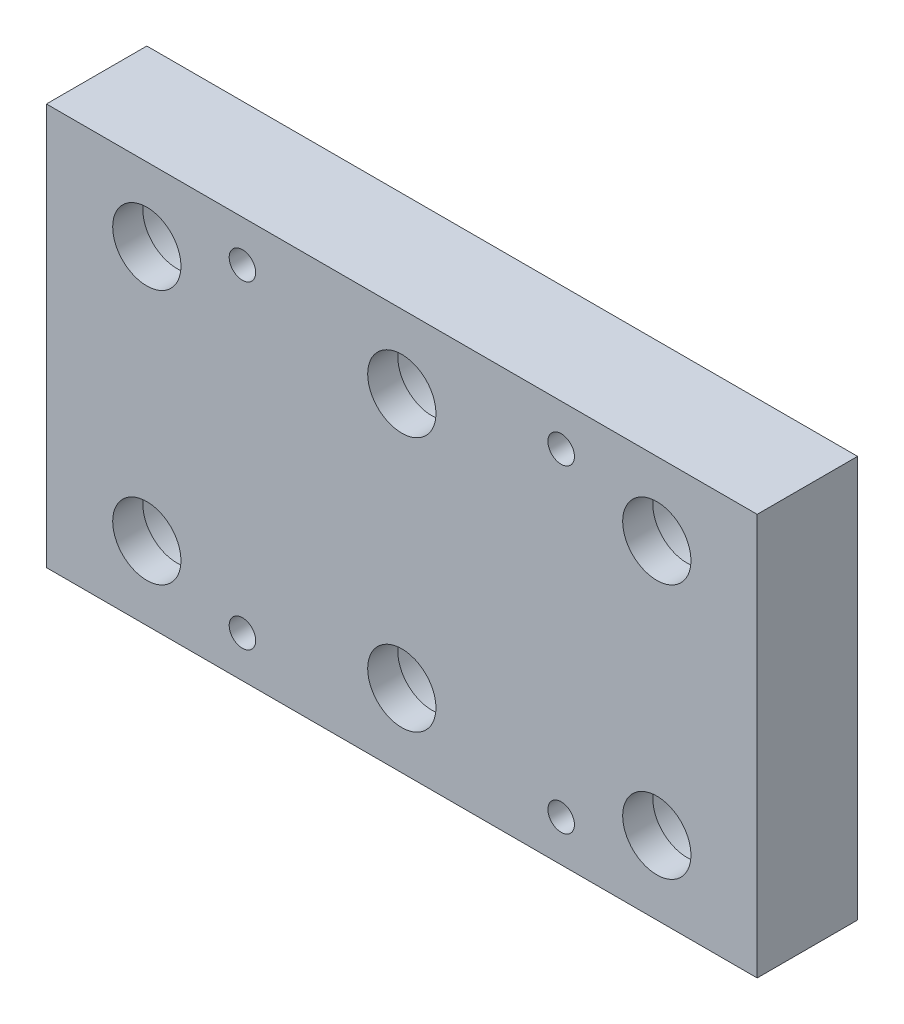
ISO-10303-21;
HEADER;
FILE_DESCRIPTION(('STEP AP214'),'2;1');
FILE_NAME('part.step','',(''),(''),'','','');
FILE_SCHEMA(('AUTOMOTIVE_DESIGN { 1 0 10303 214 1 1 1 1 }'));
ENDSEC;
DATA;
#1=APPLICATION_CONTEXT('core data for automotive mechanical design processes');
#2=APPLICATION_PROTOCOL_DEFINITION('international standard','automotive_design',2000,#1);
#3=PRODUCT_CONTEXT('',#1,'mechanical');
#4=PRODUCT('Part','Part','',(#3));
#5=PRODUCT_RELATED_PRODUCT_CATEGORY('part','',(#4));
#6=PRODUCT_DEFINITION_FORMATION('','',#4);
#7=PRODUCT_DEFINITION_CONTEXT('part definition',#1,'design');
#8=PRODUCT_DEFINITION('design','',#6,#7);
#9=PRODUCT_DEFINITION_SHAPE('','',#8);
#10=(LENGTH_UNIT() NAMED_UNIT(*) SI_UNIT(.MILLI.,.METRE.));
#11=(NAMED_UNIT(*) PLANE_ANGLE_UNIT() SI_UNIT($,.RADIAN.));
#12=(NAMED_UNIT(*) SI_UNIT($,.STERADIAN.) SOLID_ANGLE_UNIT());
#13=UNCERTAINTY_MEASURE_WITH_UNIT(LENGTH_MEASURE(1.E-05),#10,'distance_accuracy_value','');
#14=(GEOMETRIC_REPRESENTATION_CONTEXT(3) GLOBAL_UNCERTAINTY_ASSIGNED_CONTEXT((#13)) GLOBAL_UNIT_ASSIGNED_CONTEXT((#10,
#11,#12)) REPRESENTATION_CONTEXT('',''));
#15=CARTESIAN_POINT('',(0.,0.,0.));
#16=DIRECTION('',(0.,0.,1.));
#17=DIRECTION('',(1.,0.,0.));
#18=AXIS2_PLACEMENT_3D('',#15,#16,#17);
#19=CARTESIAN_POINT('',(-25.4,12.7,10.));
#20=DIRECTION('',(0.,0.,-1.));
#21=DIRECTION('',(-1.,0.,0.));
#22=AXIS2_PLACEMENT_3D('',#19,#20,#21);
#23=CYLINDRICAL_SURFACE('',#22,3.4);
#24=CARTESIAN_POINT('',(-25.4,12.7,10.));
#25=DIRECTION('',(0.,0.,-1.));
#26=DIRECTION('',(-1.,0.,0.));
#27=AXIS2_PLACEMENT_3D('',#24,#25,#26);
#28=CIRCLE('',#27,3.4);
#29=CARTESIAN_POINT('',(-28.8,12.7,10.));
#30=VERTEX_POINT('',#29);
#31=EDGE_CURVE('E165',#30,#30,#28,.T.);
#32=ORIENTED_EDGE('',*,*,#31,.F.);
#33=EDGE_LOOP('',(#32));
#34=FACE_BOUND('',#33,.T.);
#35=CARTESIAN_POINT('',(-25.4,12.7,7.));
#36=DIRECTION('',(0.,0.,-1.));
#37=DIRECTION('',(-1.,0.,0.));
#38=AXIS2_PLACEMENT_3D('',#35,#36,#37);
#39=CIRCLE('',#38,3.4);
#40=CARTESIAN_POINT('',(-28.8,12.7,7.));
#41=VERTEX_POINT('',#40);
#42=EDGE_CURVE('E39',#41,#41,#39,.F.);
#43=ORIENTED_EDGE('',*,*,#42,.F.);
#44=EDGE_LOOP('',(#43));
#45=FACE_BOUND('',#44,.T.);
#46=ADVANCED_FACE('F35',(#34,#45),#23,.F.);
#47=CARTESIAN_POINT('',(25.4,12.7,10.));
#48=DIRECTION('',(0.,0.,-1.));
#49=DIRECTION('',(-1.,0.,0.));
#50=AXIS2_PLACEMENT_3D('',#47,#48,#49);
#51=CYLINDRICAL_SURFACE('',#50,3.4);
#52=CARTESIAN_POINT('',(25.4,12.7,10.));
#53=DIRECTION('',(0.,0.,-1.));
#54=DIRECTION('',(-1.,0.,0.));
#55=AXIS2_PLACEMENT_3D('',#52,#53,#54);
#56=CIRCLE('',#55,3.4);
#57=CARTESIAN_POINT('',(22.,12.7,10.));
#58=VERTEX_POINT('',#57);
#59=EDGE_CURVE('E114',#58,#58,#56,.T.);
#60=ORIENTED_EDGE('',*,*,#59,.F.);
#61=EDGE_LOOP('',(#60));
#62=FACE_BOUND('',#61,.T.);
#63=CARTESIAN_POINT('',(25.4,12.7,7.));
#64=DIRECTION('',(0.,0.,-1.));
#65=DIRECTION('',(-1.,0.,0.));
#66=AXIS2_PLACEMENT_3D('',#63,#64,#65);
#67=CIRCLE('',#66,3.4);
#68=CARTESIAN_POINT('',(22.,12.7,7.));
#69=VERTEX_POINT('',#68);
#70=EDGE_CURVE('E130',#69,#69,#67,.F.);
#71=ORIENTED_EDGE('',*,*,#70,.F.);
#72=EDGE_LOOP('',(#71));
#73=FACE_BOUND('',#72,.T.);
#74=ADVANCED_FACE('F221',(#62,#73),#51,.F.);
#75=CARTESIAN_POINT('',(0.,12.7,10.));
#76=DIRECTION('',(0.,0.,-1.));
#77=DIRECTION('',(-1.,0.,0.));
#78=AXIS2_PLACEMENT_3D('',#75,#76,#77);
#79=CYLINDRICAL_SURFACE('',#78,3.4);
#80=CARTESIAN_POINT('',(0.,12.7,10.));
#81=DIRECTION('',(0.,0.,-1.));
#82=DIRECTION('',(-1.,0.,0.));
#83=AXIS2_PLACEMENT_3D('',#80,#81,#82);
#84=CIRCLE('',#83,3.4);
#85=CARTESIAN_POINT('',(-3.39999999999999,12.7,10.));
#86=VERTEX_POINT('',#85);
#87=EDGE_CURVE('E168',#86,#86,#84,.T.);
#88=ORIENTED_EDGE('',*,*,#87,.F.);
#89=EDGE_LOOP('',(#88));
#90=FACE_BOUND('',#89,.T.);
#91=CARTESIAN_POINT('',(0.,12.7,7.));
#92=DIRECTION('',(0.,0.,-1.));
#93=DIRECTION('',(-1.,0.,0.));
#94=AXIS2_PLACEMENT_3D('',#91,#92,#93);
#95=CIRCLE('',#94,3.4);
#96=CARTESIAN_POINT('',(-3.39999999999999,12.7,7.));
#97=VERTEX_POINT('',#96);
#98=EDGE_CURVE('E126',#97,#97,#95,.F.);
#99=ORIENTED_EDGE('',*,*,#98,.F.);
#100=EDGE_LOOP('',(#99));
#101=FACE_BOUND('',#100,.T.);
#102=ADVANCED_FACE('F227',(#90,#101),#79,.F.);
#103=CARTESIAN_POINT('',(25.4,-12.7,10.));
#104=DIRECTION('',(0.,0.,-1.));
#105=DIRECTION('',(-1.,0.,0.));
#106=AXIS2_PLACEMENT_3D('',#103,#104,#105);
#107=CYLINDRICAL_SURFACE('',#106,3.4);
#108=CARTESIAN_POINT('',(25.4,-12.7,10.));
#109=DIRECTION('',(0.,0.,-1.));
#110=DIRECTION('',(-1.,0.,0.));
#111=AXIS2_PLACEMENT_3D('',#108,#109,#110);
#112=CIRCLE('',#111,3.4);
#113=CARTESIAN_POINT('',(22.,-12.7,10.));
#114=VERTEX_POINT('',#113);
#115=EDGE_CURVE('E177',#114,#114,#112,.T.);
#116=ORIENTED_EDGE('',*,*,#115,.F.);
#117=EDGE_LOOP('',(#116));
#118=FACE_BOUND('',#117,.T.);
#119=CARTESIAN_POINT('',(25.4,-12.7,7.));
#120=DIRECTION('',(0.,0.,-1.));
#121=DIRECTION('',(-1.,0.,0.));
#122=AXIS2_PLACEMENT_3D('',#119,#120,#121);
#123=CIRCLE('',#122,3.4);
#124=CARTESIAN_POINT('',(22.,-12.7,7.));
#125=VERTEX_POINT('',#124);
#126=EDGE_CURVE('E121',#125,#125,#123,.F.);
#127=ORIENTED_EDGE('',*,*,#126,.F.);
#128=EDGE_LOOP('',(#127));
#129=FACE_BOUND('',#128,.T.);
#130=ADVANCED_FACE('F236',(#118,#129),#107,.F.);
#131=CARTESIAN_POINT('',(0.,-12.7,10.));
#132=DIRECTION('',(0.,0.,-1.));
#133=DIRECTION('',(-1.,0.,0.));
#134=AXIS2_PLACEMENT_3D('',#131,#132,#133);
#135=CYLINDRICAL_SURFACE('',#134,3.4);
#136=CARTESIAN_POINT('',(0.,-12.7,10.));
#137=DIRECTION('',(0.,0.,-1.));
#138=DIRECTION('',(-1.,0.,0.));
#139=AXIS2_PLACEMENT_3D('',#136,#137,#138);
#140=CIRCLE('',#139,3.4);
#141=CARTESIAN_POINT('',(-3.39999999999999,-12.7,10.));
#142=VERTEX_POINT('',#141);
#143=EDGE_CURVE('E174',#142,#142,#140,.T.);
#144=ORIENTED_EDGE('',*,*,#143,.F.);
#145=EDGE_LOOP('',(#144));
#146=FACE_BOUND('',#145,.T.);
#147=CARTESIAN_POINT('',(0.,-12.7,7.));
#148=DIRECTION('',(0.,0.,-1.));
#149=DIRECTION('',(-1.,0.,0.));
#150=AXIS2_PLACEMENT_3D('',#147,#148,#149);
#151=CIRCLE('',#150,3.4);
#152=CARTESIAN_POINT('',(-3.39999999999999,-12.7,7.));
#153=VERTEX_POINT('',#152);
#154=EDGE_CURVE('E116',#153,#153,#151,.F.);
#155=ORIENTED_EDGE('',*,*,#154,.F.);
#156=EDGE_LOOP('',(#155));
#157=FACE_BOUND('',#156,.T.);
#158=ADVANCED_FACE('F241',(#146,#157),#135,.F.);
#159=CARTESIAN_POINT('',(-25.4,-12.7,10.));
#160=DIRECTION('',(0.,0.,-1.));
#161=DIRECTION('',(-1.,0.,0.));
#162=AXIS2_PLACEMENT_3D('',#159,#160,#161);
#163=CYLINDRICAL_SURFACE('',#162,3.4);
#164=CARTESIAN_POINT('',(-25.4,-12.7,10.));
#165=DIRECTION('',(0.,0.,-1.));
#166=DIRECTION('',(-1.,0.,0.));
#167=AXIS2_PLACEMENT_3D('',#164,#165,#166);
#168=CIRCLE('',#167,3.4);
#169=CARTESIAN_POINT('',(-28.8,-12.7,10.));
#170=VERTEX_POINT('',#169);
#171=EDGE_CURVE('E171',#170,#170,#168,.T.);
#172=ORIENTED_EDGE('',*,*,#171,.F.);
#173=EDGE_LOOP('',(#172));
#174=FACE_BOUND('',#173,.T.);
#175=CARTESIAN_POINT('',(-25.4,-12.7,7.));
#176=DIRECTION('',(0.,0.,-1.));
#177=DIRECTION('',(-1.,0.,0.));
#178=AXIS2_PLACEMENT_3D('',#175,#176,#177);
#179=CIRCLE('',#178,3.4);
#180=CARTESIAN_POINT('',(-28.8,-12.7,7.));
#181=VERTEX_POINT('',#180);
#182=EDGE_CURVE('E111',#181,#181,#179,.F.);
#183=ORIENTED_EDGE('',*,*,#182,.F.);
#184=EDGE_LOOP('',(#183));
#185=FACE_BOUND('',#184,.T.);
#186=ADVANCED_FACE('F238',(#174,#185),#163,.F.);
#187=CARTESIAN_POINT('',(35.4,20.,10.));
#188=DIRECTION('',(-1.,0.,0.));
#189=DIRECTION('',(0.,0.,1.));
#190=AXIS2_PLACEMENT_3D('',#187,#188,#189);
#191=PLANE('',#190);
#192=DIRECTION('',(0.,1.,0.));
#193=VECTOR('',#192,1.);
#194=CARTESIAN_POINT('',(35.4,20.,0.));
#195=LINE('',#194,#193);
#196=CARTESIAN_POINT('',(35.4,-20.,0.));
#197=VERTEX_POINT('',#196);
#198=CARTESIAN_POINT('',(35.4,20.,0.));
#199=VERTEX_POINT('',#198);
#200=EDGE_CURVE('E102',#197,#199,#195,.T.);
#201=ORIENTED_EDGE('',*,*,#200,.T.);
#202=DIRECTION('',(0.,0.,-1.));
#203=VECTOR('',#202,1.);
#204=CARTESIAN_POINT('',(35.4,20.,10.));
#205=LINE('',#204,#203);
#206=CARTESIAN_POINT('',(35.4,20.,10.));
#207=VERTEX_POINT('',#206);
#208=EDGE_CURVE('E11',#207,#199,#205,.T.);
#209=ORIENTED_EDGE('',*,*,#208,.F.);
#210=DIRECTION('',(0.,1.,0.));
#211=VECTOR('',#210,1.);
#212=CARTESIAN_POINT('',(35.4,20.,10.));
#213=LINE('',#212,#211);
#214=CARTESIAN_POINT('',(35.4,-20.,10.));
#215=VERTEX_POINT('',#214);
#216=EDGE_CURVE('E89',#215,#207,#213,.T.);
#217=ORIENTED_EDGE('',*,*,#216,.F.);
#218=DIRECTION('',(0.,0.,-1.));
#219=VECTOR('',#218,1.);
#220=CARTESIAN_POINT('',(35.4,-20.,10.));
#221=LINE('',#220,#219);
#222=EDGE_CURVE('E98',#215,#197,#221,.T.);
#223=ORIENTED_EDGE('',*,*,#222,.T.);
#224=EDGE_LOOP('',(#201,#209,#217,#223));
#225=FACE_BOUND('',#224,.T.);
#226=ADVANCED_FACE('F37',(#225),#191,.F.);
#227=CARTESIAN_POINT('',(35.4,20.,10.));
#228=DIRECTION('',(0.,-1.,0.));
#229=DIRECTION('',(0.,0.,-1.));
#230=AXIS2_PLACEMENT_3D('',#227,#228,#229);
#231=PLANE('',#230);
#232=DIRECTION('',(-1.,0.,0.));
#233=VECTOR('',#232,1.);
#234=CARTESIAN_POINT('',(35.4,20.,0.));
#235=LINE('',#234,#233);
#236=CARTESIAN_POINT('',(-35.4,20.,0.));
#237=VERTEX_POINT('',#236);
#238=EDGE_CURVE('E93',#199,#237,#235,.T.);
#239=ORIENTED_EDGE('',*,*,#238,.T.);
#240=DIRECTION('',(0.,0.,-1.));
#241=VECTOR('',#240,1.);
#242=CARTESIAN_POINT('',(-35.4,20.,10.));
#243=LINE('',#242,#241);
#244=CARTESIAN_POINT('',(-35.4,20.,10.));
#245=VERTEX_POINT('',#244);
#246=EDGE_CURVE('E45',#245,#237,#243,.T.);
#247=ORIENTED_EDGE('',*,*,#246,.F.);
#248=DIRECTION('',(-1.,0.,0.));
#249=VECTOR('',#248,1.);
#250=CARTESIAN_POINT('',(35.4,20.,10.));
#251=LINE('',#250,#249);
#252=EDGE_CURVE('E84',#207,#245,#251,.T.);
#253=ORIENTED_EDGE('',*,*,#252,.F.);
#254=ORIENTED_EDGE('',*,*,#208,.T.);
#255=EDGE_LOOP('',(#239,#247,#253,#254));
#256=FACE_BOUND('',#255,.T.);
#257=ADVANCED_FACE('F92',(#256),#231,.F.);
#258=CARTESIAN_POINT('',(-35.4,20.,10.));
#259=DIRECTION('',(1.,0.,0.));
#260=DIRECTION('',(0.,0.,-1.));
#261=AXIS2_PLACEMENT_3D('',#258,#259,#260);
#262=PLANE('',#261);
#263=DIRECTION('',(0.,-1.,0.));
#264=VECTOR('',#263,1.);
#265=CARTESIAN_POINT('',(-35.4,20.,0.));
#266=LINE('',#265,#264);
#267=CARTESIAN_POINT('',(-35.4,-20.,0.));
#268=VERTEX_POINT('',#267);
#269=EDGE_CURVE('E71',#237,#268,#266,.T.);
#270=ORIENTED_EDGE('',*,*,#269,.T.);
#271=DIRECTION('',(0.,0.,-1.));
#272=VECTOR('',#271,1.);
#273=CARTESIAN_POINT('',(-35.4,-20.,10.));
#274=LINE('',#273,#272);
#275=CARTESIAN_POINT('',(-35.4,-20.,10.));
#276=VERTEX_POINT('',#275);
#277=EDGE_CURVE('E94',#276,#268,#274,.T.);
#278=ORIENTED_EDGE('',*,*,#277,.F.);
#279=DIRECTION('',(0.,-1.,0.));
#280=VECTOR('',#279,1.);
#281=CARTESIAN_POINT('',(-35.4,20.,10.));
#282=LINE('',#281,#280);
#283=EDGE_CURVE('E87',#245,#276,#282,.T.);
#284=ORIENTED_EDGE('',*,*,#283,.F.);
#285=ORIENTED_EDGE('',*,*,#246,.T.);
#286=EDGE_LOOP('',(#270,#278,#284,#285));
#287=FACE_BOUND('',#286,.T.);
#288=ADVANCED_FACE('F96',(#287),#262,.F.);
#289=CARTESIAN_POINT('',(35.4,-20.,10.));
#290=DIRECTION('',(0.,1.,0.));
#291=DIRECTION('',(0.,0.,1.));
#292=AXIS2_PLACEMENT_3D('',#289,#290,#291);
#293=PLANE('',#292);
#294=DIRECTION('',(1.,0.,0.));
#295=VECTOR('',#294,1.);
#296=CARTESIAN_POINT('',(35.4,-20.,0.));
#297=LINE('',#296,#295);
#298=EDGE_CURVE('E77',#268,#197,#297,.T.);
#299=ORIENTED_EDGE('',*,*,#298,.T.);
#300=ORIENTED_EDGE('',*,*,#222,.F.);
#301=DIRECTION('',(1.,0.,0.));
#302=VECTOR('',#301,1.);
#303=CARTESIAN_POINT('',(35.4,-20.,10.));
#304=LINE('',#303,#302);
#305=EDGE_CURVE('E54',#276,#215,#304,.T.);
#306=ORIENTED_EDGE('',*,*,#305,.F.);
#307=ORIENTED_EDGE('',*,*,#277,.T.);
#308=EDGE_LOOP('',(#299,#300,#306,#307));
#309=FACE_BOUND('',#308,.T.);
#310=ADVANCED_FACE('F208',(#309),#293,.F.);
#311=CARTESIAN_POINT('',(0.,0.,10.));
#312=DIRECTION('',(0.,0.,-1.));
#313=DIRECTION('',(-1.,0.,0.));
#314=AXIS2_PLACEMENT_3D('',#311,#312,#313);
#315=PLANE('',#314);
#316=ORIENTED_EDGE('',*,*,#59,.T.);
#317=EDGE_LOOP('',(#316));
#318=FACE_BOUND('',#317,.T.);
#319=ORIENTED_EDGE('',*,*,#31,.T.);
#320=EDGE_LOOP('',(#319));
#321=FACE_BOUND('',#320,.T.);
#322=ORIENTED_EDGE('',*,*,#87,.T.);
#323=EDGE_LOOP('',(#322));
#324=FACE_BOUND('',#323,.T.);
#325=ORIENTED_EDGE('',*,*,#171,.T.);
#326=EDGE_LOOP('',(#325));
#327=FACE_BOUND('',#326,.T.);
#328=ORIENTED_EDGE('',*,*,#143,.T.);
#329=EDGE_LOOP('',(#328));
#330=FACE_BOUND('',#329,.T.);
#331=ORIENTED_EDGE('',*,*,#115,.T.);
#332=EDGE_LOOP('',(#331));
#333=FACE_BOUND('',#332,.T.);
#334=CARTESIAN_POINT('',(15.875,15.8749999999999,10.));
#335=DIRECTION('',(0.,0.,1.));
#336=DIRECTION('',(1.,0.,0.));
#337=AXIS2_PLACEMENT_3D('',#334,#335,#336);
#338=CIRCLE('',#337,1.32);
#339=CARTESIAN_POINT('',(17.195,15.8749999999999,10.));
#340=VERTEX_POINT('',#339);
#341=EDGE_CURVE('E180',#340,#340,#338,.T.);
#342=ORIENTED_EDGE('',*,*,#341,.F.);
#343=EDGE_LOOP('',(#342));
#344=FACE_BOUND('',#343,.T.);
#345=CARTESIAN_POINT('',(-15.875,15.8749999999999,10.));
#346=DIRECTION('',(0.,0.,1.));
#347=DIRECTION('',(1.,0.,0.));
#348=AXIS2_PLACEMENT_3D('',#345,#346,#347);
#349=CIRCLE('',#348,1.32);
#350=CARTESIAN_POINT('',(-14.555,15.8749999999999,10.));
#351=VERTEX_POINT('',#350);
#352=EDGE_CURVE('E184',#351,#351,#349,.T.);
#353=ORIENTED_EDGE('',*,*,#352,.F.);
#354=EDGE_LOOP('',(#353));
#355=FACE_BOUND('',#354,.T.);
#356=CARTESIAN_POINT('',(-15.875,-15.8749999999999,10.));
#357=DIRECTION('',(0.,0.,1.));
#358=DIRECTION('',(1.,0.,0.));
#359=AXIS2_PLACEMENT_3D('',#356,#357,#358);
#360=CIRCLE('',#359,1.31999999999994);
#361=CARTESIAN_POINT('',(-14.5550000000001,-15.8749999999999,10.));
#362=VERTEX_POINT('',#361);
#363=EDGE_CURVE('E190',#362,#362,#360,.T.);
#364=ORIENTED_EDGE('',*,*,#363,.F.);
#365=EDGE_LOOP('',(#364));
#366=FACE_BOUND('',#365,.T.);
#367=CARTESIAN_POINT('',(15.875,-15.8749999999999,10.));
#368=DIRECTION('',(0.,0.,1.));
#369=DIRECTION('',(1.,0.,0.));
#370=AXIS2_PLACEMENT_3D('',#367,#368,#369);
#371=CIRCLE('',#370,1.32);
#372=CARTESIAN_POINT('',(17.195,-15.8749999999999,10.));
#373=VERTEX_POINT('',#372);
#374=EDGE_CURVE('E196',#373,#373,#371,.T.);
#375=ORIENTED_EDGE('',*,*,#374,.F.);
#376=EDGE_LOOP('',(#375));
#377=FACE_BOUND('',#376,.T.);
#378=ORIENTED_EDGE('',*,*,#216,.T.);
#379=ORIENTED_EDGE('',*,*,#252,.T.);
#380=ORIENTED_EDGE('',*,*,#283,.T.);
#381=ORIENTED_EDGE('',*,*,#305,.T.);
#382=EDGE_LOOP('',(#378,#379,#380,#381));
#383=FACE_BOUND('',#382,.T.);
#384=ADVANCED_FACE('F85',(#318,#321,#324,#327,#330,#333,#344,#355,#366,#377,#383),#315,.F.);
#385=CARTESIAN_POINT('',(0.,0.,0.));
#386=DIRECTION('',(0.,0.,-1.));
#387=DIRECTION('',(-1.,0.,0.));
#388=AXIS2_PLACEMENT_3D('',#385,#386,#387);
#389=PLANE('',#388);
#390=CARTESIAN_POINT('',(-25.4,12.7,0.));
#391=DIRECTION('',(0.,0.,-1.));
#392=DIRECTION('',(-1.,0.,0.));
#393=AXIS2_PLACEMENT_3D('',#390,#391,#392);
#394=CIRCLE('',#393,5.37499999999999);
#395=CARTESIAN_POINT('',(-30.775,12.7,0.));
#396=VERTEX_POINT('',#395);
#397=EDGE_CURVE('E146',#396,#396,#394,.T.);
#398=ORIENTED_EDGE('',*,*,#397,.F.);
#399=EDGE_LOOP('',(#398));
#400=FACE_BOUND('',#399,.T.);
#401=CARTESIAN_POINT('',(25.4,12.7,0.));
#402=DIRECTION('',(0.,0.,-1.));
#403=DIRECTION('',(-1.,0.,0.));
#404=AXIS2_PLACEMENT_3D('',#401,#402,#403);
#405=CIRCLE('',#404,5.375);
#406=CARTESIAN_POINT('',(20.025,12.7,0.));
#407=VERTEX_POINT('',#406);
#408=EDGE_CURVE('E139',#407,#407,#405,.T.);
#409=ORIENTED_EDGE('',*,*,#408,.F.);
#410=EDGE_LOOP('',(#409));
#411=FACE_BOUND('',#410,.T.);
#412=CARTESIAN_POINT('',(0.,12.7,0.));
#413=DIRECTION('',(0.,0.,-1.));
#414=DIRECTION('',(-1.,0.,0.));
#415=AXIS2_PLACEMENT_3D('',#412,#413,#414);
#416=CIRCLE('',#415,5.375);
#417=CARTESIAN_POINT('',(-5.37499999999999,12.7,0.));
#418=VERTEX_POINT('',#417);
#419=EDGE_CURVE('E132',#418,#418,#416,.T.);
#420=ORIENTED_EDGE('',*,*,#419,.F.);
#421=EDGE_LOOP('',(#420));
#422=FACE_BOUND('',#421,.T.);
#423=CARTESIAN_POINT('',(25.4,-12.7,0.));
#424=DIRECTION('',(0.,0.,-1.));
#425=DIRECTION('',(-1.,0.,0.));
#426=AXIS2_PLACEMENT_3D('',#423,#424,#425);
#427=CIRCLE('',#426,5.375);
#428=CARTESIAN_POINT('',(20.025,-12.7,0.));
#429=VERTEX_POINT('',#428);
#430=EDGE_CURVE('E128',#429,#429,#427,.T.);
#431=ORIENTED_EDGE('',*,*,#430,.F.);
#432=EDGE_LOOP('',(#431));
#433=FACE_BOUND('',#432,.T.);
#434=CARTESIAN_POINT('',(0.,-12.7,0.));
#435=DIRECTION('',(0.,0.,-1.));
#436=DIRECTION('',(-1.,0.,0.));
#437=AXIS2_PLACEMENT_3D('',#434,#435,#436);
#438=CIRCLE('',#437,5.375);
#439=CARTESIAN_POINT('',(-5.37500000000001,-12.7,0.));
#440=VERTEX_POINT('',#439);
#441=EDGE_CURVE('E124',#440,#440,#438,.T.);
#442=ORIENTED_EDGE('',*,*,#441,.F.);
#443=EDGE_LOOP('',(#442));
#444=FACE_BOUND('',#443,.T.);
#445=CARTESIAN_POINT('',(-25.4,-12.7,0.));
#446=DIRECTION('',(0.,0.,-1.));
#447=DIRECTION('',(-1.,0.,0.));
#448=AXIS2_PLACEMENT_3D('',#445,#446,#447);
#449=CIRCLE('',#448,5.375);
#450=CARTESIAN_POINT('',(-30.775,-12.7,0.));
#451=VERTEX_POINT('',#450);
#452=EDGE_CURVE('E119',#451,#451,#449,.T.);
#453=ORIENTED_EDGE('',*,*,#452,.F.);
#454=EDGE_LOOP('',(#453));
#455=FACE_BOUND('',#454,.T.);
#456=CARTESIAN_POINT('',(15.875,15.8749999999999,0.));
#457=DIRECTION('',(0.,0.,1.));
#458=DIRECTION('',(1.,0.,0.));
#459=AXIS2_PLACEMENT_3D('',#456,#457,#458);
#460=CIRCLE('',#459,1.32);
#461=CARTESIAN_POINT('',(17.195,15.8749999999999,0.));
#462=VERTEX_POINT('',#461);
#463=EDGE_CURVE('E181',#462,#462,#460,.T.);
#464=ORIENTED_EDGE('',*,*,#463,.T.);
#465=EDGE_LOOP('',(#464));
#466=FACE_BOUND('',#465,.T.);
#467=CARTESIAN_POINT('',(-15.875,15.8749999999999,0.));
#468=DIRECTION('',(0.,0.,1.));
#469=DIRECTION('',(1.,0.,0.));
#470=AXIS2_PLACEMENT_3D('',#467,#468,#469);
#471=CIRCLE('',#470,1.32);
#472=CARTESIAN_POINT('',(-14.555,15.8749999999999,0.));
#473=VERTEX_POINT('',#472);
#474=EDGE_CURVE('E187',#473,#473,#471,.T.);
#475=ORIENTED_EDGE('',*,*,#474,.T.);
#476=EDGE_LOOP('',(#475));
#477=FACE_BOUND('',#476,.T.);
#478=CARTESIAN_POINT('',(-15.875,-15.8749999999999,0.));
#479=DIRECTION('',(0.,0.,1.));
#480=DIRECTION('',(1.,0.,0.));
#481=AXIS2_PLACEMENT_3D('',#478,#479,#480);
#482=CIRCLE('',#481,1.31999999999994);
#483=CARTESIAN_POINT('',(-14.5550000000001,-15.8749999999999,0.));
#484=VERTEX_POINT('',#483);
#485=EDGE_CURVE('E193',#484,#484,#482,.T.);
#486=ORIENTED_EDGE('',*,*,#485,.T.);
#487=EDGE_LOOP('',(#486));
#488=FACE_BOUND('',#487,.T.);
#489=CARTESIAN_POINT('',(15.875,-15.8749999999999,0.));
#490=DIRECTION('',(0.,0.,1.));
#491=DIRECTION('',(1.,0.,0.));
#492=AXIS2_PLACEMENT_3D('',#489,#490,#491);
#493=CIRCLE('',#492,1.32);
#494=CARTESIAN_POINT('',(17.195,-15.8749999999999,0.));
#495=VERTEX_POINT('',#494);
#496=EDGE_CURVE('E105',#495,#495,#493,.T.);
#497=ORIENTED_EDGE('',*,*,#496,.T.);
#498=EDGE_LOOP('',(#497));
#499=FACE_BOUND('',#498,.T.);
#500=ORIENTED_EDGE('',*,*,#200,.F.);
#501=ORIENTED_EDGE('',*,*,#298,.F.);
#502=ORIENTED_EDGE('',*,*,#269,.F.);
#503=ORIENTED_EDGE('',*,*,#238,.F.);
#504=EDGE_LOOP('',(#500,#501,#502,#503));
#505=FACE_BOUND('',#504,.T.);
#506=ADVANCED_FACE('F207',(#400,#411,#422,#433,#444,#455,#466,#477,#488,#499,#505),#389,.T.);
#507=CARTESIAN_POINT('',(15.875,-15.8749999999999,0.));
#508=DIRECTION('',(0.,0.,1.));
#509=DIRECTION('',(1.,0.,0.));
#510=AXIS2_PLACEMENT_3D('',#507,#508,#509);
#511=CYLINDRICAL_SURFACE('',#510,1.32);
#512=ORIENTED_EDGE('',*,*,#496,.F.);
#513=EDGE_LOOP('',(#512));
#514=FACE_BOUND('',#513,.T.);
#515=ORIENTED_EDGE('',*,*,#374,.T.);
#516=EDGE_LOOP('',(#515));
#517=FACE_BOUND('',#516,.T.);
#518=ADVANCED_FACE('F204',(#514,#517),#511,.F.);
#519=CARTESIAN_POINT('',(-15.875,-15.8749999999999,0.));
#520=DIRECTION('',(0.,0.,1.));
#521=DIRECTION('',(1.,0.,0.));
#522=AXIS2_PLACEMENT_3D('',#519,#520,#521);
#523=CYLINDRICAL_SURFACE('',#522,1.31999999999994);
#524=ORIENTED_EDGE('',*,*,#485,.F.);
#525=EDGE_LOOP('',(#524));
#526=FACE_BOUND('',#525,.T.);
#527=ORIENTED_EDGE('',*,*,#363,.T.);
#528=EDGE_LOOP('',(#527));
#529=FACE_BOUND('',#528,.T.);
#530=ADVANCED_FACE('F257',(#526,#529),#523,.F.);
#531=CARTESIAN_POINT('',(-15.875,15.8749999999999,0.));
#532=DIRECTION('',(0.,0.,1.));
#533=DIRECTION('',(1.,0.,0.));
#534=AXIS2_PLACEMENT_3D('',#531,#532,#533);
#535=CYLINDRICAL_SURFACE('',#534,1.32);
#536=ORIENTED_EDGE('',*,*,#474,.F.);
#537=EDGE_LOOP('',(#536));
#538=FACE_BOUND('',#537,.T.);
#539=ORIENTED_EDGE('',*,*,#352,.T.);
#540=EDGE_LOOP('',(#539));
#541=FACE_BOUND('',#540,.T.);
#542=ADVANCED_FACE('F253',(#538,#541),#535,.F.);
#543=CARTESIAN_POINT('',(15.875,15.8749999999999,0.));
#544=DIRECTION('',(0.,0.,1.));
#545=DIRECTION('',(1.,0.,0.));
#546=AXIS2_PLACEMENT_3D('',#543,#544,#545);
#547=CYLINDRICAL_SURFACE('',#546,1.32);
#548=ORIENTED_EDGE('',*,*,#463,.F.);
#549=EDGE_LOOP('',(#548));
#550=FACE_BOUND('',#549,.T.);
#551=ORIENTED_EDGE('',*,*,#341,.T.);
#552=EDGE_LOOP('',(#551));
#553=FACE_BOUND('',#552,.T.);
#554=ADVANCED_FACE('F249',(#550,#553),#547,.F.);
#555=CARTESIAN_POINT('',(-25.4,-12.7,7.));
#556=DIRECTION('',(0.,0.,-1.));
#557=DIRECTION('',(-1.,0.,0.));
#558=AXIS2_PLACEMENT_3D('',#555,#556,#557);
#559=PLANE('',#558);
#560=CARTESIAN_POINT('',(-25.4,-12.7,7.));
#561=DIRECTION('',(0.,0.,-1.));
#562=DIRECTION('',(-1.,0.,0.));
#563=AXIS2_PLACEMENT_3D('',#560,#561,#562);
#564=CIRCLE('',#563,5.375);
#565=CARTESIAN_POINT('',(-30.775,-12.7,7.));
#566=VERTEX_POINT('',#565);
#567=EDGE_CURVE('E115',#566,#566,#564,.T.);
#568=ORIENTED_EDGE('',*,*,#567,.T.);
#569=EDGE_LOOP('',(#568));
#570=FACE_BOUND('',#569,.T.);
#571=ORIENTED_EDGE('',*,*,#182,.T.);
#572=EDGE_LOOP('',(#571));
#573=FACE_BOUND('',#572,.T.);
#574=ADVANCED_FACE('F252',(#570,#573),#559,.T.);
#575=CARTESIAN_POINT('',(-25.4,-12.7,7.));
#576=DIRECTION('',(0.,0.,-1.));
#577=DIRECTION('',(-1.,0.,0.));
#578=AXIS2_PLACEMENT_3D('',#575,#576,#577);
#579=CYLINDRICAL_SURFACE('',#578,5.375);
#580=ORIENTED_EDGE('',*,*,#567,.F.);
#581=EDGE_LOOP('',(#580));
#582=FACE_BOUND('',#581,.T.);
#583=ORIENTED_EDGE('',*,*,#452,.T.);
#584=EDGE_LOOP('',(#583));
#585=FACE_BOUND('',#584,.T.);
#586=ADVANCED_FACE('F362',(#582,#585),#579,.F.);
#587=CARTESIAN_POINT('',(0.,-12.7,7.));
#588=DIRECTION('',(0.,0.,-1.));
#589=DIRECTION('',(-1.,0.,0.));
#590=AXIS2_PLACEMENT_3D('',#587,#588,#589);
#591=PLANE('',#590);
#592=CARTESIAN_POINT('',(0.,-12.7,7.));
#593=DIRECTION('',(0.,0.,-1.));
#594=DIRECTION('',(-1.,0.,0.));
#595=AXIS2_PLACEMENT_3D('',#592,#593,#594);
#596=CIRCLE('',#595,5.375);
#597=CARTESIAN_POINT('',(-5.37500000000001,-12.7,7.));
#598=VERTEX_POINT('',#597);
#599=EDGE_CURVE('E120',#598,#598,#596,.T.);
#600=ORIENTED_EDGE('',*,*,#599,.T.);
#601=EDGE_LOOP('',(#600));
#602=FACE_BOUND('',#601,.T.);
#603=ORIENTED_EDGE('',*,*,#154,.T.);
#604=EDGE_LOOP('',(#603));
#605=FACE_BOUND('',#604,.T.);
#606=ADVANCED_FACE('F372',(#602,#605),#591,.T.);
#607=CARTESIAN_POINT('',(0.,-12.7,7.));
#608=DIRECTION('',(0.,0.,-1.));
#609=DIRECTION('',(-1.,0.,0.));
#610=AXIS2_PLACEMENT_3D('',#607,#608,#609);
#611=CYLINDRICAL_SURFACE('',#610,5.375);
#612=ORIENTED_EDGE('',*,*,#599,.F.);
#613=EDGE_LOOP('',(#612));
#614=FACE_BOUND('',#613,.T.);
#615=ORIENTED_EDGE('',*,*,#441,.T.);
#616=EDGE_LOOP('',(#615));
#617=FACE_BOUND('',#616,.T.);
#618=ADVANCED_FACE('F381',(#614,#617),#611,.F.);
#619=CARTESIAN_POINT('',(25.4,-12.7,7.));
#620=DIRECTION('',(0.,0.,-1.));
#621=DIRECTION('',(-1.,0.,0.));
#622=AXIS2_PLACEMENT_3D('',#619,#620,#621);
#623=PLANE('',#622);
#624=CARTESIAN_POINT('',(25.4,-12.7,7.));
#625=DIRECTION('',(0.,0.,-1.));
#626=DIRECTION('',(-1.,0.,0.));
#627=AXIS2_PLACEMENT_3D('',#624,#625,#626);
#628=CIRCLE('',#627,5.375);
#629=CARTESIAN_POINT('',(20.025,-12.7,7.));
#630=VERTEX_POINT('',#629);
#631=EDGE_CURVE('E125',#630,#630,#628,.T.);
#632=ORIENTED_EDGE('',*,*,#631,.T.);
#633=EDGE_LOOP('',(#632));
#634=FACE_BOUND('',#633,.T.);
#635=ORIENTED_EDGE('',*,*,#126,.T.);
#636=EDGE_LOOP('',(#635));
#637=FACE_BOUND('',#636,.T.);
#638=ADVANCED_FACE('F391',(#634,#637),#623,.T.);
#639=CARTESIAN_POINT('',(25.4,-12.7,7.));
#640=DIRECTION('',(0.,0.,-1.));
#641=DIRECTION('',(-1.,0.,0.));
#642=AXIS2_PLACEMENT_3D('',#639,#640,#641);
#643=CYLINDRICAL_SURFACE('',#642,5.375);
#644=ORIENTED_EDGE('',*,*,#631,.F.);
#645=EDGE_LOOP('',(#644));
#646=FACE_BOUND('',#645,.T.);
#647=ORIENTED_EDGE('',*,*,#430,.T.);
#648=EDGE_LOOP('',(#647));
#649=FACE_BOUND('',#648,.T.);
#650=ADVANCED_FACE('F401',(#646,#649),#643,.F.);
#651=CARTESIAN_POINT('',(0.,12.7,7.));
#652=DIRECTION('',(0.,0.,-1.));
#653=DIRECTION('',(-1.,0.,0.));
#654=AXIS2_PLACEMENT_3D('',#651,#652,#653);
#655=PLANE('',#654);
#656=CARTESIAN_POINT('',(0.,12.7,7.));
#657=DIRECTION('',(0.,0.,-1.));
#658=DIRECTION('',(-1.,0.,0.));
#659=AXIS2_PLACEMENT_3D('',#656,#657,#658);
#660=CIRCLE('',#659,5.375);
#661=CARTESIAN_POINT('',(-5.37499999999999,12.7,7.));
#662=VERTEX_POINT('',#661);
#663=EDGE_CURVE('E129',#662,#662,#660,.T.);
#664=ORIENTED_EDGE('',*,*,#663,.T.);
#665=EDGE_LOOP('',(#664));
#666=FACE_BOUND('',#665,.T.);
#667=ORIENTED_EDGE('',*,*,#98,.T.);
#668=EDGE_LOOP('',(#667));
#669=FACE_BOUND('',#668,.T.);
#670=ADVANCED_FACE('F411',(#666,#669),#655,.T.);
#671=CARTESIAN_POINT('',(0.,12.7,7.));
#672=DIRECTION('',(0.,0.,-1.));
#673=DIRECTION('',(-1.,0.,0.));
#674=AXIS2_PLACEMENT_3D('',#671,#672,#673);
#675=CYLINDRICAL_SURFACE('',#674,5.375);
#676=ORIENTED_EDGE('',*,*,#663,.F.);
#677=EDGE_LOOP('',(#676));
#678=FACE_BOUND('',#677,.T.);
#679=ORIENTED_EDGE('',*,*,#419,.T.);
#680=EDGE_LOOP('',(#679));
#681=FACE_BOUND('',#680,.T.);
#682=ADVANCED_FACE('F421',(#678,#681),#675,.F.);
#683=CARTESIAN_POINT('',(25.4,12.7,7.));
#684=DIRECTION('',(0.,0.,-1.));
#685=DIRECTION('',(-1.,0.,0.));
#686=AXIS2_PLACEMENT_3D('',#683,#684,#685);
#687=PLANE('',#686);
#688=CARTESIAN_POINT('',(25.4,12.7,7.));
#689=DIRECTION('',(0.,0.,-1.));
#690=DIRECTION('',(-1.,0.,0.));
#691=AXIS2_PLACEMENT_3D('',#688,#689,#690);
#692=CIRCLE('',#691,5.375);
#693=CARTESIAN_POINT('',(20.025,12.7,7.));
#694=VERTEX_POINT('',#693);
#695=EDGE_CURVE('E133',#694,#694,#692,.T.);
#696=ORIENTED_EDGE('',*,*,#695,.T.);
#697=EDGE_LOOP('',(#696));
#698=FACE_BOUND('',#697,.T.);
#699=ORIENTED_EDGE('',*,*,#70,.T.);
#700=EDGE_LOOP('',(#699));
#701=FACE_BOUND('',#700,.T.);
#702=ADVANCED_FACE('F431',(#698,#701),#687,.T.);
#703=CARTESIAN_POINT('',(25.4,12.7,7.));
#704=DIRECTION('',(0.,0.,-1.));
#705=DIRECTION('',(-1.,0.,0.));
#706=AXIS2_PLACEMENT_3D('',#703,#704,#705);
#707=CYLINDRICAL_SURFACE('',#706,5.375);
#708=ORIENTED_EDGE('',*,*,#695,.F.);
#709=EDGE_LOOP('',(#708));
#710=FACE_BOUND('',#709,.T.);
#711=ORIENTED_EDGE('',*,*,#408,.T.);
#712=EDGE_LOOP('',(#711));
#713=FACE_BOUND('',#712,.T.);
#714=ADVANCED_FACE('F441',(#710,#713),#707,.F.);
#715=CARTESIAN_POINT('',(-25.4,12.7,7.));
#716=DIRECTION('',(0.,0.,-1.));
#717=DIRECTION('',(-1.,0.,0.));
#718=AXIS2_PLACEMENT_3D('',#715,#716,#717);
#719=PLANE('',#718);
#720=CARTESIAN_POINT('',(-25.4,12.7,7.));
#721=DIRECTION('',(0.,0.,-1.));
#722=DIRECTION('',(-1.,0.,0.));
#723=AXIS2_PLACEMENT_3D('',#720,#721,#722);
#724=CIRCLE('',#723,5.37499999999999);
#725=CARTESIAN_POINT('',(-30.775,12.7,7.));
#726=VERTEX_POINT('',#725);
#727=EDGE_CURVE('E477',#726,#726,#724,.T.);
#728=ORIENTED_EDGE('',*,*,#727,.T.);
#729=EDGE_LOOP('',(#728));
#730=FACE_BOUND('',#729,.T.);
#731=ORIENTED_EDGE('',*,*,#42,.T.);
#732=EDGE_LOOP('',(#731));
#733=FACE_BOUND('',#732,.T.);
#734=ADVANCED_FACE('F450',(#730,#733),#719,.T.);
#735=CARTESIAN_POINT('',(-25.4,12.7,7.));
#736=DIRECTION('',(0.,0.,-1.));
#737=DIRECTION('',(-1.,0.,0.));
#738=AXIS2_PLACEMENT_3D('',#735,#736,#737);
#739=CYLINDRICAL_SURFACE('',#738,5.37499999999999);
#740=ORIENTED_EDGE('',*,*,#727,.F.);
#741=EDGE_LOOP('',(#740));
#742=FACE_BOUND('',#741,.T.);
#743=ORIENTED_EDGE('',*,*,#397,.T.);
#744=EDGE_LOOP('',(#743));
#745=FACE_BOUND('',#744,.T.);
#746=ADVANCED_FACE('F460',(#742,#745),#739,.F.);
#747=CLOSED_SHELL('',(#46,#74,#102,#130,#158,#186,#226,#257,#288,#310,#384,#506,#518,#530,#542,
#554,#574,#586,#606,#618,#638,#650,#670,#682,#702,#714,#734,#746));
#748=MANIFOLD_SOLID_BREP('B2',#747);
#749=ADVANCED_BREP_SHAPE_REPRESENTATION('',(#18,#748),#14);
#750=SHAPE_DEFINITION_REPRESENTATION(#9,#749);
ENDSEC;
END-ISO-10303-21;
